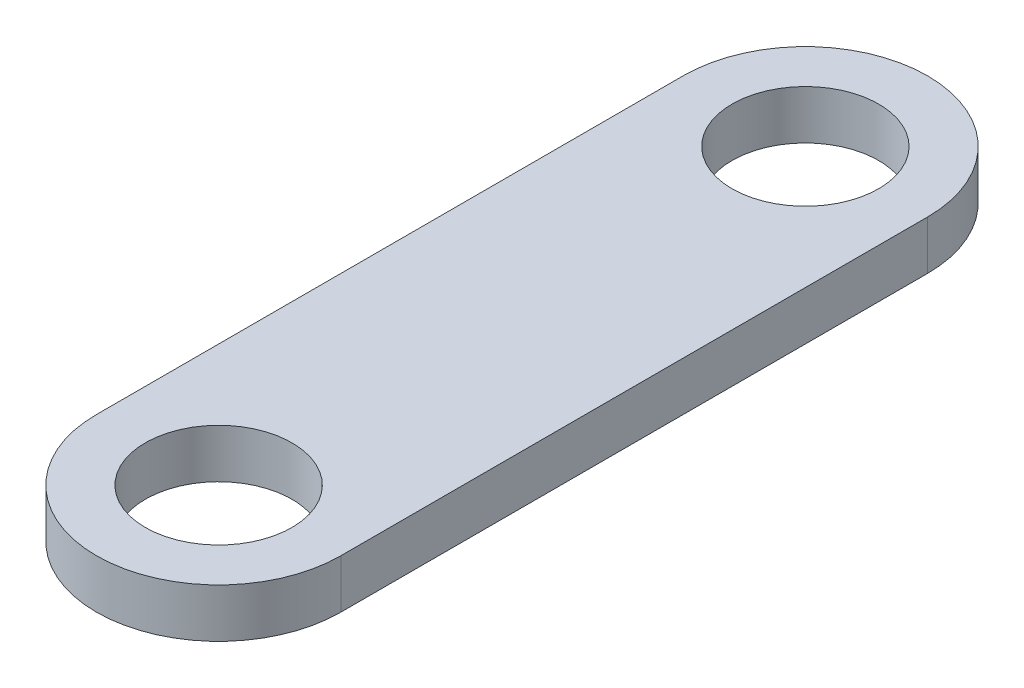
ISO-10303-21;
HEADER;
FILE_DESCRIPTION(('STEP AP214'),'2;1');
FILE_NAME('part.step','',(''),(''),'','','');
FILE_SCHEMA(('AUTOMOTIVE_DESIGN { 1 0 10303 214 1 1 1 1 }'));
ENDSEC;
DATA;
#1=APPLICATION_CONTEXT('core data for automotive mechanical design processes');
#2=APPLICATION_PROTOCOL_DEFINITION('international standard','automotive_design',2000,#1);
#3=PRODUCT_CONTEXT('',#1,'mechanical');
#4=PRODUCT('Part','Part','',(#3));
#5=PRODUCT_RELATED_PRODUCT_CATEGORY('part','',(#4));
#6=PRODUCT_DEFINITION_FORMATION('','',#4);
#7=PRODUCT_DEFINITION_CONTEXT('part definition',#1,'design');
#8=PRODUCT_DEFINITION('design','',#6,#7);
#9=PRODUCT_DEFINITION_SHAPE('','',#8);
#10=(LENGTH_UNIT() NAMED_UNIT(*) SI_UNIT(.MILLI.,.METRE.));
#11=(NAMED_UNIT(*) PLANE_ANGLE_UNIT() SI_UNIT($,.RADIAN.));
#12=(NAMED_UNIT(*) SI_UNIT($,.STERADIAN.) SOLID_ANGLE_UNIT());
#13=UNCERTAINTY_MEASURE_WITH_UNIT(LENGTH_MEASURE(1.E-05),#10,'distance_accuracy_value','');
#14=(GEOMETRIC_REPRESENTATION_CONTEXT(3) GLOBAL_UNCERTAINTY_ASSIGNED_CONTEXT((#13)) GLOBAL_UNIT_ASSIGNED_CONTEXT((#10,
#11,#12)) REPRESENTATION_CONTEXT('',''));
#15=CARTESIAN_POINT('',(0.,0.,0.));
#16=DIRECTION('',(0.,0.,1.));
#17=DIRECTION('',(1.,0.,0.));
#18=AXIS2_PLACEMENT_3D('',#15,#16,#17);
#19=CARTESIAN_POINT('',(0.,1.,0.));
#20=DIRECTION('',(0.,1.,0.));
#21=DIRECTION('',(0.,0.,1.));
#22=AXIS2_PLACEMENT_3D('',#19,#20,#21);
#23=PLANE('',#22);
#24=CARTESIAN_POINT('',(0.,1.,0.));
#25=DIRECTION('',(0.,1.,0.));
#26=DIRECTION('',(0.,0.,1.));
#27=AXIS2_PLACEMENT_3D('',#24,#25,#26);
#28=CIRCLE('',#27,1.5);
#29=CARTESIAN_POINT('',(0.,1.,1.5));
#30=VERTEX_POINT('',#29);
#31=EDGE_CURVE('E101',#30,#30,#28,.T.);
#32=ORIENTED_EDGE('',*,*,#31,.F.);
#33=EDGE_LOOP('',(#32));
#34=FACE_BOUND('',#33,.T.);
#35=CARTESIAN_POINT('',(0.,1.,0.));
#36=DIRECTION('',(0.,1.,0.));
#37=DIRECTION('',(0.,0.,1.));
#38=AXIS2_PLACEMENT_3D('',#35,#36,#37);
#39=CIRCLE('',#38,2.5);
#40=CARTESIAN_POINT('',(2.5,1.,0.));
#41=VERTEX_POINT('',#40);
#42=CARTESIAN_POINT('',(-2.5,1.,0.));
#43=VERTEX_POINT('',#42);
#44=EDGE_CURVE('E86',#41,#43,#39,.T.);
#45=ORIENTED_EDGE('',*,*,#44,.T.);
#46=DIRECTION('',(0.,0.,1.));
#47=VECTOR('',#46,1.);
#48=CARTESIAN_POINT('',(-2.5,1.,0.));
#49=LINE('',#48,#47);
#50=CARTESIAN_POINT('',(-2.5,1.,12.));
#51=VERTEX_POINT('',#50);
#52=EDGE_CURVE('E81',#43,#51,#49,.T.);
#53=ORIENTED_EDGE('',*,*,#52,.T.);
#54=CARTESIAN_POINT('',(0.,1.,12.));
#55=DIRECTION('',(0.,1.,0.));
#56=DIRECTION('',(0.,0.,1.));
#57=AXIS2_PLACEMENT_3D('',#54,#55,#56);
#58=CIRCLE('',#57,2.5);
#59=CARTESIAN_POINT('',(2.5,1.,12.));
#60=VERTEX_POINT('',#59);
#61=EDGE_CURVE('E84',#51,#60,#58,.T.);
#62=ORIENTED_EDGE('',*,*,#61,.T.);
#63=DIRECTION('',(0.,0.,-1.));
#64=VECTOR('',#63,1.);
#65=CARTESIAN_POINT('',(2.5,1.,12.));
#66=LINE('',#65,#64);
#67=EDGE_CURVE('E51',#60,#41,#66,.T.);
#68=ORIENTED_EDGE('',*,*,#67,.T.);
#69=EDGE_LOOP('',(#45,#53,#62,#68));
#70=FACE_BOUND('',#69,.T.);
#71=CARTESIAN_POINT('',(0.,1.,12.));
#72=DIRECTION('',(0.,1.,0.));
#73=DIRECTION('',(0.,0.,1.));
#74=AXIS2_PLACEMENT_3D('',#71,#72,#73);
#75=CIRCLE('',#74,1.5);
#76=CARTESIAN_POINT('',(0.,1.,13.5));
#77=VERTEX_POINT('',#76);
#78=EDGE_CURVE('E116',#77,#77,#75,.T.);
#79=ORIENTED_EDGE('',*,*,#78,.F.);
#80=EDGE_LOOP('',(#79));
#81=FACE_BOUND('',#80,.T.);
#82=ADVANCED_FACE('F34',(#34,#70,#81),#23,.T.);
#83=CARTESIAN_POINT('',(0.,0.,0.));
#84=DIRECTION('',(0.,1.,0.));
#85=DIRECTION('',(0.,0.,1.));
#86=AXIS2_PLACEMENT_3D('',#83,#84,#85);
#87=PLANE('',#86);
#88=CARTESIAN_POINT('',(0.,0.,0.));
#89=DIRECTION('',(0.,1.,0.));
#90=DIRECTION('',(0.,0.,1.));
#91=AXIS2_PLACEMENT_3D('',#88,#89,#90);
#92=CIRCLE('',#91,2.5);
#93=CARTESIAN_POINT('',(2.5,0.,0.));
#94=VERTEX_POINT('',#93);
#95=CARTESIAN_POINT('',(-2.5,0.,0.));
#96=VERTEX_POINT('',#95);
#97=EDGE_CURVE('E98',#94,#96,#92,.T.);
#98=ORIENTED_EDGE('',*,*,#97,.F.);
#99=DIRECTION('',(0.,0.,-1.));
#100=VECTOR('',#99,1.);
#101=CARTESIAN_POINT('',(2.5,0.,12.));
#102=LINE('',#101,#100);
#103=CARTESIAN_POINT('',(2.5,0.,12.));
#104=VERTEX_POINT('',#103);
#105=EDGE_CURVE('E74',#104,#94,#102,.T.);
#106=ORIENTED_EDGE('',*,*,#105,.F.);
#107=CARTESIAN_POINT('',(0.,0.,12.));
#108=DIRECTION('',(0.,1.,0.));
#109=DIRECTION('',(0.,0.,1.));
#110=AXIS2_PLACEMENT_3D('',#107,#108,#109);
#111=CIRCLE('',#110,2.5);
#112=CARTESIAN_POINT('',(-2.5,0.,12.));
#113=VERTEX_POINT('',#112);
#114=EDGE_CURVE('E68',#113,#104,#111,.T.);
#115=ORIENTED_EDGE('',*,*,#114,.F.);
#116=DIRECTION('',(0.,0.,1.));
#117=VECTOR('',#116,1.);
#118=CARTESIAN_POINT('',(-2.5,0.,0.));
#119=LINE('',#118,#117);
#120=EDGE_CURVE('E90',#96,#113,#119,.T.);
#121=ORIENTED_EDGE('',*,*,#120,.F.);
#122=EDGE_LOOP('',(#98,#106,#115,#121));
#123=FACE_BOUND('',#122,.T.);
#124=CARTESIAN_POINT('',(0.,0.,0.));
#125=DIRECTION('',(0.,1.,0.));
#126=DIRECTION('',(0.,0.,1.));
#127=AXIS2_PLACEMENT_3D('',#124,#125,#126);
#128=CIRCLE('',#127,1.5);
#129=CARTESIAN_POINT('',(0.,0.,1.5));
#130=VERTEX_POINT('',#129);
#131=EDGE_CURVE('E113',#130,#130,#128,.T.);
#132=ORIENTED_EDGE('',*,*,#131,.T.);
#133=EDGE_LOOP('',(#132));
#134=FACE_BOUND('',#133,.T.);
#135=CARTESIAN_POINT('',(0.,0.,12.));
#136=DIRECTION('',(0.,1.,0.));
#137=DIRECTION('',(0.,0.,1.));
#138=AXIS2_PLACEMENT_3D('',#135,#136,#137);
#139=CIRCLE('',#138,1.5);
#140=CARTESIAN_POINT('',(0.,0.,13.5));
#141=VERTEX_POINT('',#140);
#142=EDGE_CURVE('E119',#141,#141,#139,.T.);
#143=ORIENTED_EDGE('',*,*,#142,.T.);
#144=EDGE_LOOP('',(#143));
#145=FACE_BOUND('',#144,.T.);
#146=ADVANCED_FACE('F109',(#123,#134,#145),#87,.F.);
#147=CARTESIAN_POINT('',(0.,1.,0.));
#148=DIRECTION('',(0.,-1.,0.));
#149=DIRECTION('',(0.,0.,-1.));
#150=AXIS2_PLACEMENT_3D('',#147,#148,#149);
#151=CYLINDRICAL_SURFACE('',#150,2.5);
#152=ORIENTED_EDGE('',*,*,#97,.T.);
#153=DIRECTION('',(0.,-1.,0.));
#154=VECTOR('',#153,1.);
#155=CARTESIAN_POINT('',(-2.5,1.,0.));
#156=LINE('',#155,#154);
#157=EDGE_CURVE('E11',#43,#96,#156,.T.);
#158=ORIENTED_EDGE('',*,*,#157,.F.);
#159=ORIENTED_EDGE('',*,*,#44,.F.);
#160=DIRECTION('',(0.,-1.,0.));
#161=VECTOR('',#160,1.);
#162=CARTESIAN_POINT('',(2.5,1.,0.));
#163=LINE('',#162,#161);
#164=EDGE_CURVE('E94',#41,#94,#163,.T.);
#165=ORIENTED_EDGE('',*,*,#164,.T.);
#166=EDGE_LOOP('',(#152,#158,#159,#165));
#167=FACE_BOUND('',#166,.T.);
#168=ADVANCED_FACE('F36',(#167),#151,.T.);
#169=CARTESIAN_POINT('',(-2.5,1.,0.));
#170=DIRECTION('',(1.,0.,0.));
#171=DIRECTION('',(0.,0.,-1.));
#172=AXIS2_PLACEMENT_3D('',#169,#170,#171);
#173=PLANE('',#172);
#174=ORIENTED_EDGE('',*,*,#120,.T.);
#175=DIRECTION('',(0.,-1.,0.));
#176=VECTOR('',#175,1.);
#177=CARTESIAN_POINT('',(-2.5,1.,12.));
#178=LINE('',#177,#176);
#179=EDGE_CURVE('E43',#51,#113,#178,.T.);
#180=ORIENTED_EDGE('',*,*,#179,.F.);
#181=ORIENTED_EDGE('',*,*,#52,.F.);
#182=ORIENTED_EDGE('',*,*,#157,.T.);
#183=EDGE_LOOP('',(#174,#180,#181,#182));
#184=FACE_BOUND('',#183,.T.);
#185=ADVANCED_FACE('F89',(#184),#173,.F.);
#186=CARTESIAN_POINT('',(0.,1.,12.));
#187=DIRECTION('',(0.,-1.,0.));
#188=DIRECTION('',(0.,0.,-1.));
#189=AXIS2_PLACEMENT_3D('',#186,#187,#188);
#190=CYLINDRICAL_SURFACE('',#189,2.5);
#191=ORIENTED_EDGE('',*,*,#114,.T.);
#192=DIRECTION('',(0.,-1.,0.));
#193=VECTOR('',#192,1.);
#194=CARTESIAN_POINT('',(2.5,1.,12.));
#195=LINE('',#194,#193);
#196=EDGE_CURVE('E91',#60,#104,#195,.T.);
#197=ORIENTED_EDGE('',*,*,#196,.F.);
#198=ORIENTED_EDGE('',*,*,#61,.F.);
#199=ORIENTED_EDGE('',*,*,#179,.T.);
#200=EDGE_LOOP('',(#191,#197,#198,#199));
#201=FACE_BOUND('',#200,.T.);
#202=ADVANCED_FACE('F92',(#201),#190,.T.);
#203=CARTESIAN_POINT('',(2.5,1.,12.));
#204=DIRECTION('',(-1.,0.,0.));
#205=DIRECTION('',(0.,0.,1.));
#206=AXIS2_PLACEMENT_3D('',#203,#204,#205);
#207=PLANE('',#206);
#208=ORIENTED_EDGE('',*,*,#105,.T.);
#209=ORIENTED_EDGE('',*,*,#164,.F.);
#210=ORIENTED_EDGE('',*,*,#67,.F.);
#211=ORIENTED_EDGE('',*,*,#196,.T.);
#212=EDGE_LOOP('',(#208,#209,#210,#211));
#213=FACE_BOUND('',#212,.T.);
#214=ADVANCED_FACE('F106',(#213),#207,.F.);
#215=CARTESIAN_POINT('',(0.,1.,0.));
#216=DIRECTION('',(0.,-1.,0.));
#217=DIRECTION('',(0.,0.,-1.));
#218=AXIS2_PLACEMENT_3D('',#215,#216,#217);
#219=CYLINDRICAL_SURFACE('',#218,1.5);
#220=ORIENTED_EDGE('',*,*,#31,.T.);
#221=EDGE_LOOP('',(#220));
#222=FACE_BOUND('',#221,.T.);
#223=ORIENTED_EDGE('',*,*,#131,.F.);
#224=EDGE_LOOP('',(#223));
#225=FACE_BOUND('',#224,.T.);
#226=ADVANCED_FACE('F136',(#222,#225),#219,.F.);
#227=CARTESIAN_POINT('',(0.,1.,12.));
#228=DIRECTION('',(0.,-1.,0.));
#229=DIRECTION('',(0.,0.,-1.));
#230=AXIS2_PLACEMENT_3D('',#227,#228,#229);
#231=CYLINDRICAL_SURFACE('',#230,1.5);
#232=ORIENTED_EDGE('',*,*,#78,.T.);
#233=EDGE_LOOP('',(#232));
#234=FACE_BOUND('',#233,.T.);
#235=ORIENTED_EDGE('',*,*,#142,.F.);
#236=EDGE_LOOP('',(#235));
#237=FACE_BOUND('',#236,.T.);
#238=ADVANCED_FACE('F125',(#234,#237),#231,.F.);
#239=CLOSED_SHELL('',(#82,#146,#168,#185,#202,#214,#226,#238));
#240=MANIFOLD_SOLID_BREP('B2',#239);
#241=ADVANCED_BREP_SHAPE_REPRESENTATION('',(#18,#240),#14);
#242=SHAPE_DEFINITION_REPRESENTATION(#9,#241);
ENDSEC;
END-ISO-10303-21;
